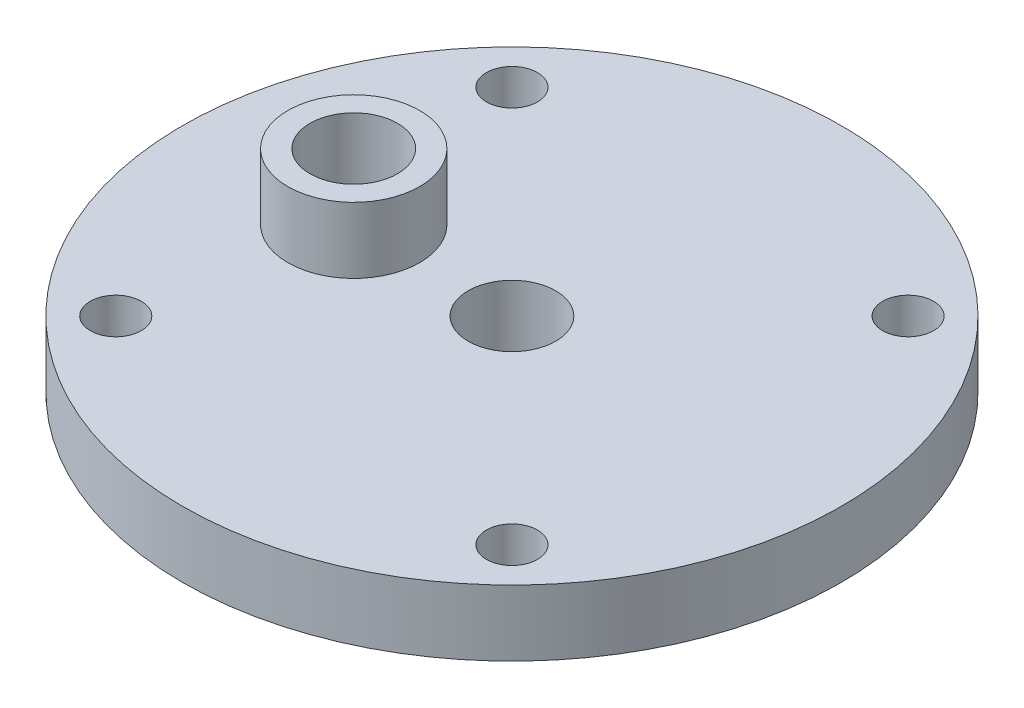
ISO-10303-21;
HEADER;
FILE_DESCRIPTION(('STEP AP214'),'2;1');
FILE_NAME('part.step','',(''),(''),'','','');
FILE_SCHEMA(('AUTOMOTIVE_DESIGN { 1 0 10303 214 1 1 1 1 }'));
ENDSEC;
DATA;
#1=APPLICATION_CONTEXT('core data for automotive mechanical design processes');
#2=APPLICATION_PROTOCOL_DEFINITION('international standard','automotive_design',2000,#1);
#3=PRODUCT_CONTEXT('',#1,'mechanical');
#4=PRODUCT('Part','Part','',(#3));
#5=PRODUCT_RELATED_PRODUCT_CATEGORY('part','',(#4));
#6=PRODUCT_DEFINITION_FORMATION('','',#4);
#7=PRODUCT_DEFINITION_CONTEXT('part definition',#1,'design');
#8=PRODUCT_DEFINITION('design','',#6,#7);
#9=PRODUCT_DEFINITION_SHAPE('','',#8);
#10=(LENGTH_UNIT() NAMED_UNIT(*) SI_UNIT(.MILLI.,.METRE.));
#11=(NAMED_UNIT(*) PLANE_ANGLE_UNIT() SI_UNIT($,.RADIAN.));
#12=(NAMED_UNIT(*) SI_UNIT($,.STERADIAN.) SOLID_ANGLE_UNIT());
#13=UNCERTAINTY_MEASURE_WITH_UNIT(LENGTH_MEASURE(1.E-05),#10,'distance_accuracy_value','');
#14=(GEOMETRIC_REPRESENTATION_CONTEXT(3) GLOBAL_UNCERTAINTY_ASSIGNED_CONTEXT((#13)) GLOBAL_UNIT_ASSIGNED_CONTEXT((#10,
#11,#12)) REPRESENTATION_CONTEXT('',''));
#15=CARTESIAN_POINT('',(0.,0.,0.));
#16=DIRECTION('',(0.,0.,1.));
#17=DIRECTION('',(1.,0.,0.));
#18=AXIS2_PLACEMENT_3D('',#15,#16,#17);
#19=CARTESIAN_POINT('',(0.,0.,0.));
#20=DIRECTION('',(0.,-1.,0.));
#21=DIRECTION('',(0.,0.,-1.));
#22=AXIS2_PLACEMENT_3D('',#19,#20,#21);
#23=PLANE('',#22);
#24=CARTESIAN_POINT('',(0.,0.,-6.34999999999999));
#25=DIRECTION('',(0.,-1.,0.));
#26=DIRECTION('',(0.,0.,-1.));
#27=AXIS2_PLACEMENT_3D('',#24,#25,#26);
#28=ELLIPSE('',#27,0.359210244842765,0.253999999999999);
#29=CARTESIAN_POINT('',(0.,0.,-6.70921024484276));
#30=VERTEX_POINT('',#29);
#31=EDGE_CURVE('E183',#30,#30,#28,.T.);
#32=ORIENTED_EDGE('',*,*,#31,.F.);
#33=EDGE_LOOP('',(#32));
#34=FACE_BOUND('',#33,.T.);
#35=CARTESIAN_POINT('',(-6.34999999999999,0.,0.));
#36=DIRECTION('',(0.,-1.,0.));
#37=DIRECTION('',(-1.,0.,0.));
#38=AXIS2_PLACEMENT_3D('',#35,#36,#37);
#39=ELLIPSE('',#38,0.359210244842765,0.253999999999999);
#40=CARTESIAN_POINT('',(-6.70921024484276,0.,0.));
#41=VERTEX_POINT('',#40);
#42=EDGE_CURVE('E187',#41,#41,#39,.T.);
#43=ORIENTED_EDGE('',*,*,#42,.F.);
#44=EDGE_LOOP('',(#43));
#45=FACE_BOUND('',#44,.T.);
#46=CARTESIAN_POINT('',(0.,0.,6.34999999999999));
#47=DIRECTION('',(0.,-1.,0.));
#48=DIRECTION('',(0.,0.,1.));
#49=AXIS2_PLACEMENT_3D('',#46,#47,#48);
#50=ELLIPSE('',#49,0.359210244842765,0.253999999999999);
#51=CARTESIAN_POINT('',(0.,0.,6.70921024484276));
#52=VERTEX_POINT('',#51);
#53=EDGE_CURVE('E191',#52,#52,#50,.T.);
#54=ORIENTED_EDGE('',*,*,#53,.F.);
#55=EDGE_LOOP('',(#54));
#56=FACE_BOUND('',#55,.T.);
#57=CARTESIAN_POINT('',(6.34999999999999,0.,0.));
#58=DIRECTION('',(0.,-1.,0.));
#59=DIRECTION('',(1.,0.,0.));
#60=AXIS2_PLACEMENT_3D('',#57,#58,#59);
#61=ELLIPSE('',#60,0.359210244842765,0.253999999999999);
#62=CARTESIAN_POINT('',(6.70921024484276,0.,0.));
#63=VERTEX_POINT('',#62);
#64=EDGE_CURVE('E195',#63,#63,#61,.T.);
#65=ORIENTED_EDGE('',*,*,#64,.F.);
#66=EDGE_LOOP('',(#65));
#67=FACE_BOUND('',#66,.T.);
#68=CARTESIAN_POINT('',(0.,0.,0.));
#69=DIRECTION('',(0.,-1.,0.));
#70=DIRECTION('',(0.,0.,-1.));
#71=AXIS2_PLACEMENT_3D('',#68,#69,#70);
#72=CIRCLE('',#71,4.21639999999999);
#73=CARTESIAN_POINT('',(0.,0.,-4.21639999999999));
#74=VERTEX_POINT('',#73);
#75=EDGE_CURVE('E199',#74,#74,#72,.T.);
#76=ORIENTED_EDGE('',*,*,#75,.F.);
#77=EDGE_LOOP('',(#76));
#78=FACE_BOUND('',#77,.T.);
#79=CARTESIAN_POINT('',(0.,0.,0.));
#80=DIRECTION('',(0.,1.,0.));
#81=DIRECTION('',(0.,0.,1.));
#82=AXIS2_PLACEMENT_3D('',#79,#80,#81);
#83=CIRCLE('',#82,15.875);
#84=CARTESIAN_POINT('',(0.,0.,15.875));
#85=VERTEX_POINT('',#84);
#86=EDGE_CURVE('E119',#85,#85,#83,.T.);
#87=ORIENTED_EDGE('',*,*,#86,.F.);
#88=EDGE_LOOP('',(#87));
#89=FACE_BOUND('',#88,.T.);
#90=ADVANCED_FACE('F37',(#34,#45,#56,#67,#78,#89),#23,.T.);
#91=CARTESIAN_POINT('',(0.,14.2875,0.));
#92=DIRECTION('',(0.,1.,0.));
#93=DIRECTION('',(0.,0.,1.));
#94=AXIS2_PLACEMENT_3D('',#91,#92,#93);
#95=CYLINDRICAL_SURFACE('',#94,15.875);
#96=ORIENTED_EDGE('',*,*,#86,.T.);
#97=EDGE_LOOP('',(#96));
#98=FACE_BOUND('',#97,.T.);
#99=CARTESIAN_POINT('',(0.,3.175,0.));
#100=DIRECTION('',(0.,1.,0.));
#101=DIRECTION('',(0.,0.,1.));
#102=AXIS2_PLACEMENT_3D('',#99,#100,#101);
#103=CIRCLE('',#102,15.875);
#104=CARTESIAN_POINT('',(0.,3.175,15.875));
#105=VERTEX_POINT('',#104);
#106=EDGE_CURVE('E115',#105,#105,#103,.T.);
#107=ORIENTED_EDGE('',*,*,#106,.F.);
#108=EDGE_LOOP('',(#107));
#109=FACE_BOUND('',#108,.T.);
#110=ADVANCED_FACE('F174',(#98,#109),#95,.T.);
#111=CARTESIAN_POINT('',(-15.875,3.175,0.));
#112=DIRECTION('',(0.,1.,0.));
#113=DIRECTION('',(0.,0.,1.));
#114=AXIS2_PLACEMENT_3D('',#111,#112,#113);
#115=PLANE('',#114);
#116=CARTESIAN_POINT('',(0.,3.175,-9.52499999999999));
#117=DIRECTION('',(0.,1.,0.));
#118=DIRECTION('',(0.,0.,-1.));
#119=AXIS2_PLACEMENT_3D('',#116,#117,#118);
#120=ELLIPSE('',#119,0.359210244842765,0.253999999999999);
#121=CARTESIAN_POINT('',(0.253988708852886,3.175,-9.52161303224276));
#122=VERTEX_POINT('',#121);
#123=CARTESIAN_POINT('',(-0.253988708852687,3.175,-9.52161303224277));
#124=VERTEX_POINT('',#123);
#125=EDGE_CURVE('E57',#122,#124,#120,.T.);
#126=ORIENTED_EDGE('',*,*,#125,.F.);
#127=CARTESIAN_POINT('',(0.,3.175,0.));
#128=DIRECTION('',(0.,1.,0.));
#129=DIRECTION('',(0.,0.,1.));
#130=AXIS2_PLACEMENT_3D('',#127,#128,#129);
#131=CIRCLE('',#130,9.525);
#132=CARTESIAN_POINT('',(9.52161303224277,3.175,-0.253988708852786));
#133=VERTEX_POINT('',#132);
#134=EDGE_CURVE('E112',#133,#122,#131,.T.);
#135=ORIENTED_EDGE('',*,*,#134,.F.);
#136=CARTESIAN_POINT('',(9.52499999999999,3.175,0.));
#137=DIRECTION('',(0.,1.,0.));
#138=DIRECTION('',(1.,0.,0.));
#139=AXIS2_PLACEMENT_3D('',#136,#137,#138);
#140=ELLIPSE('',#139,0.359210244842765,0.253999999999999);
#141=CARTESIAN_POINT('',(9.52161303224277,3.175,0.253988708852786));
#142=VERTEX_POINT('',#141);
#143=EDGE_CURVE('E219',#142,#133,#140,.T.);
#144=ORIENTED_EDGE('',*,*,#143,.F.);
#145=CARTESIAN_POINT('',(0.253988708852753,3.175,9.52161303224277));
#146=VERTEX_POINT('',#145);
#147=EDGE_CURVE('E106',#146,#142,#131,.T.);
#148=ORIENTED_EDGE('',*,*,#147,.F.);
#149=CARTESIAN_POINT('',(0.,3.175,9.52499999999999));
#150=DIRECTION('',(0.,1.,0.));
#151=DIRECTION('',(0.,0.,1.));
#152=AXIS2_PLACEMENT_3D('',#149,#150,#151);
#153=ELLIPSE('',#152,0.359210244842765,0.253999999999999);
#154=CARTESIAN_POINT('',(-0.25398870885282,3.175,9.52161303224276));
#155=VERTEX_POINT('',#154);
#156=EDGE_CURVE('E224',#155,#146,#153,.T.);
#157=ORIENTED_EDGE('',*,*,#156,.F.);
#158=CARTESIAN_POINT('',(-9.52161303224277,3.175,0.253988708852786));
#159=VERTEX_POINT('',#158);
#160=EDGE_CURVE('E334',#159,#155,#131,.T.);
#161=ORIENTED_EDGE('',*,*,#160,.F.);
#162=CARTESIAN_POINT('',(-9.52499999999999,3.175,0.));
#163=DIRECTION('',(0.,1.,0.));
#164=DIRECTION('',(-1.,0.,0.));
#165=AXIS2_PLACEMENT_3D('',#162,#163,#164);
#166=ELLIPSE('',#165,0.359210244842765,0.253999999999999);
#167=CARTESIAN_POINT('',(-9.52161303224277,3.175,-0.253988708852786));
#168=VERTEX_POINT('',#167);
#169=EDGE_CURVE('E244',#168,#159,#166,.T.);
#170=ORIENTED_EDGE('',*,*,#169,.F.);
#171=EDGE_CURVE('E116',#124,#168,#131,.T.);
#172=ORIENTED_EDGE('',*,*,#171,.F.);
#173=EDGE_LOOP('',(#126,#135,#144,#148,#157,#161,#170,#172));
#174=FACE_BOUND('',#173,.T.);
#175=ORIENTED_EDGE('',*,*,#106,.T.);
#176=EDGE_LOOP('',(#175));
#177=FACE_BOUND('',#176,.T.);
#178=ADVANCED_FACE('F171',(#174,#177),#115,.T.);
#179=CARTESIAN_POINT('',(0.,14.2875,0.));
#180=DIRECTION('',(0.,1.,0.));
#181=DIRECTION('',(0.,0.,1.));
#182=AXIS2_PLACEMENT_3D('',#179,#180,#181);
#183=CYLINDRICAL_SURFACE('',#182,9.525);
#184=CARTESIAN_POINT('',(-0.253988708852687,3.175,-9.52161303224277));
#185=CARTESIAN_POINT('',(-0.253762310380255,3.20265585750623,-9.52161504756113));
#186=CARTESIAN_POINT('',(-0.251352995068558,3.23039204658245,-9.52168301476661));
#187=CARTESIAN_POINT('',(-0.241853833190986,3.28533392360139,-9.52193133421066));
#188=CARTESIAN_POINT('',(-0.234715918134479,3.31253117755965,-9.5221128395515));
#189=CARTESIAN_POINT('',(-0.218358164602399,3.35713046459756,-9.5224989014196));
#190=CARTESIAN_POINT('',(-0.210424196374653,3.37500378633972,-9.52267981537316));
#191=CARTESIAN_POINT('',(-0.191940447112796,3.40930477629347,-9.52307043721314));
#192=CARTESIAN_POINT('',(-0.181399952222309,3.42573730195421,-9.5232800417264));
#193=CARTESIAN_POINT('',(-0.16072081194238,3.45229524343193,-9.52364790521498));
#194=CARTESIAN_POINT('',(-0.151236194408672,3.46292848395282,-9.52380481588724));
#195=CARTESIAN_POINT('',(-0.130716631136981,3.48259108965602,-9.52410852403132));
#196=CARTESIAN_POINT('',(-0.119683543210044,3.49162234787972,-9.52425533331249));
#197=CARTESIAN_POINT('',(-0.0986009468671517,3.50585400616589,-9.52449418016102));
#198=CARTESIAN_POINT('',(-0.0888270926466748,3.51146054985754,-9.52459125353317));
#199=CARTESIAN_POINT('',(-0.0684867399872461,3.52099509660636,-9.52475919099708));
#200=CARTESIAN_POINT('',(-0.0579208147797949,3.52492430004839,-9.52483007382715));
#201=CARTESIAN_POINT('',(-0.0361677863760888,3.53083391022371,-9.52493757139543));
#202=CARTESIAN_POINT('',(-0.0249768337323059,3.53280040261146,-9.52497394137182));
#203=CARTESIAN_POINT('',(-0.00242574338453218,3.53455440588581,-9.52500634993189));
#204=CARTESIAN_POINT('',(0.00893431429477872,3.53434291664427,-9.52500240702251));
#205=CARTESIAN_POINT('',(0.0301416603854675,3.53191109454994,-9.52495755460249));
#206=CARTESIAN_POINT('',(0.0400161323698642,3.52991789763793,-9.5249208254699));
#207=CARTESIAN_POINT('',(0.0593147600747716,3.52437600476957,-9.52482020620429));
#208=CARTESIAN_POINT('',(0.0687388255064597,3.52082699837295,-9.52475631065067));
#209=CARTESIAN_POINT('',(0.0873967849019367,3.51217909651797,-9.52460383298033));
#210=CARTESIAN_POINT('',(0.0965994625743298,3.50701357075855,-9.52451420679547));
#211=CARTESIAN_POINT('',(0.114201058188755,3.49546698046043,-9.52431943572887));
#212=CARTESIAN_POINT('',(0.122599552060628,3.48908527984248,-9.52421428273287));
#213=CARTESIAN_POINT('',(0.143154502534424,3.47138090609201,-9.52393251139403));
#214=CARTESIAN_POINT('',(0.154686131902399,3.45933074890186,-9.52374964140267));
#215=CARTESIAN_POINT('',(0.175688377065705,3.43354540149817,-9.5233853842257));
#216=CARTESIAN_POINT('',(0.185153417622517,3.41980580569167,-9.52320400229142));
#217=CARTESIAN_POINT('',(0.205495145645364,3.38550286469517,-9.52279047636847));
#218=CARTESIAN_POINT('',(0.215446560774838,3.36439191301757,-9.52256667442027));
#219=CARTESIAN_POINT('',(0.231869175287278,3.32086299206787,-9.52218086016359));
#220=CARTESIAN_POINT('',(0.238335691826847,3.29844330876932,-9.5220189310815));
#221=CARTESIAN_POINT('',(0.2466866766919,3.2590999999945,-9.52180566013396));
#222=CARTESIAN_POINT('',(0.249337943823236,3.24233328879731,-9.5217362419771));
#223=CARTESIAN_POINT('',(0.252924775501788,3.20871213745041,-9.52164140518111));
#224=CARTESIAN_POINT('',(0.253869940229587,3.19185872674099,-9.52161574038898));
#225=CARTESIAN_POINT('',(0.253988708852886,3.175,-9.52161303224276));
#226=B_SPLINE_CURVE_WITH_KNOTS('',3,(#184,#185,#186,#187,#188,#189,#190,#191,#192,#193,#194,
#195,#196,#197,#198,#199,#200,#201,#202,#203,#204,#205,#206,#207,#208,#209,#210,#211,#212,#213,
#214,#215,#216,#217,#218,#219,#220,#221,#222,#223,#224,#225),.UNSPECIFIED.,.F.,.F.,(4,2,2,2,2,2,
2,2,2,2,2,2,2,2,2,2,2,2,2,2,4),(0.,0.0830489779831655,0.166955416075598,0.225441836053683,
0.2837228177842,0.326332802552292,0.368892095272986,0.402564876039762,0.436213518391679,
0.470099048513841,0.503969023097582,0.534053919690414,0.564144822042937,0.595690364106974,
0.627252450509459,0.677010263021198,0.726900697383764,0.796547864387975,0.866288388098834,
0.917131095401339,0.967686809951884),.UNSPECIFIED.);
#227=EDGE_CURVE('E44',#124,#122,#226,.T.);
#228=ORIENTED_EDGE('',*,*,#227,.F.);
#229=ORIENTED_EDGE('',*,*,#171,.T.);
#230=CARTESIAN_POINT('',(-9.52161303224277,3.175,0.253988708852786));
#231=CARTESIAN_POINT('',(-9.52161504756113,3.20265585750623,0.253762310380354));
#232=CARTESIAN_POINT('',(-9.52168301476661,3.23039204658245,0.251352995068657));
#233=CARTESIAN_POINT('',(-9.52193133421066,3.2853339236014,0.241853833191085));
#234=CARTESIAN_POINT('',(-9.5221128395515,3.31253117755965,0.234715918134578));
#235=CARTESIAN_POINT('',(-9.5224989014196,3.35713046459757,0.218358164602498));
#236=CARTESIAN_POINT('',(-9.52267981537315,3.37500378633972,0.21042419637475));
#237=CARTESIAN_POINT('',(-9.52307043721313,3.40930477629347,0.191940447112894));
#238=CARTESIAN_POINT('',(-9.5232800417264,3.42573730195422,0.181399952222408));
#239=CARTESIAN_POINT('',(-9.52364790521498,3.45229524343193,0.160720811942479));
#240=CARTESIAN_POINT('',(-9.52380481588724,3.46292848395282,0.151236194408771));
#241=CARTESIAN_POINT('',(-9.52410852403132,3.48259108965602,0.130716631137079));
#242=CARTESIAN_POINT('',(-9.52425533331249,3.49162234787972,0.119683543210142));
#243=CARTESIAN_POINT('',(-9.52449418016102,3.50585400616589,0.0986009468672503));
#244=CARTESIAN_POINT('',(-9.52459125353317,3.51146054985754,0.0888270926467736));
#245=CARTESIAN_POINT('',(-9.52475919099708,3.52099509660636,0.0684867399873451));
#246=CARTESIAN_POINT('',(-9.52483007382715,3.52492430004839,0.0579208147798937));
#247=CARTESIAN_POINT('',(-9.52493757139542,3.53083391022371,0.036167786376188));
#248=CARTESIAN_POINT('',(-9.52497394137182,3.53280040261146,0.0249768337324055));
#249=CARTESIAN_POINT('',(-9.5250063499319,3.53455440588581,0.00242574338463219));
#250=CARTESIAN_POINT('',(-9.52500240702251,3.53434291664427,-0.00893431429467862));
#251=CARTESIAN_POINT('',(-9.52495755460249,3.53191109454994,-0.0301416603853672));
#252=CARTESIAN_POINT('',(-9.5249208254699,3.52991789763793,-0.0400161323697638));
#253=CARTESIAN_POINT('',(-9.52482020620429,3.52437600476957,-0.0593147600746713));
#254=CARTESIAN_POINT('',(-9.52475631065067,3.52082699837295,-0.0687388255063596));
#255=CARTESIAN_POINT('',(-9.52460383298033,3.51217909651798,-0.0873967849018369));
#256=CARTESIAN_POINT('',(-9.52451420679547,3.50701357075856,-0.0965994625742299));
#257=CARTESIAN_POINT('',(-9.52431943572887,3.49546698046043,-0.114201058188655));
#258=CARTESIAN_POINT('',(-9.52421428273287,3.48908527984248,-0.122599552060528));
#259=CARTESIAN_POINT('',(-9.52393251139404,3.47138090609201,-0.143154502534324));
#260=CARTESIAN_POINT('',(-9.52374964140267,3.45933074890186,-0.1546861319023));
#261=CARTESIAN_POINT('',(-9.5233853842257,3.43354540149817,-0.175688377065605));
#262=CARTESIAN_POINT('',(-9.52320400229142,3.41980580569167,-0.185153417622418));
#263=CARTESIAN_POINT('',(-9.52279047636847,3.38550286469517,-0.205495145645264));
#264=CARTESIAN_POINT('',(-9.52256667442027,3.36439191301757,-0.215446560774739));
#265=CARTESIAN_POINT('',(-9.52218086016359,3.32086299206787,-0.231869175287179));
#266=CARTESIAN_POINT('',(-9.52201893108151,3.29844330876932,-0.238335691826748));
#267=CARTESIAN_POINT('',(-9.52180566013396,3.2590999999945,-0.246686676691801));
#268=CARTESIAN_POINT('',(-9.5217362419771,3.24233328879731,-0.249337943823137));
#269=CARTESIAN_POINT('',(-9.52164140518112,3.20871213745041,-0.252924775501688));
#270=CARTESIAN_POINT('',(-9.52161574038898,3.19185872674099,-0.253869940229487));
#271=CARTESIAN_POINT('',(-9.52161303224276,3.175,-0.253988708852786));
#272=B_SPLINE_CURVE_WITH_KNOTS('',3,(#230,#231,#232,#233,#234,#235,#236,#237,#238,#239,#240,
#241,#242,#243,#244,#245,#246,#247,#248,#249,#250,#251,#252,#253,#254,#255,#256,#257,#258,#259,
#260,#261,#262,#263,#264,#265,#266,#267,#268,#269,#270,#271),.UNSPECIFIED.,.F.,.F.,(4,2,2,2,2,2,
2,2,2,2,2,2,2,2,2,2,2,2,2,2,4),(0.,0.0830489779831668,0.166955416075601,0.225441836053685,
0.283722817784202,0.326332802552293,0.368892095272987,0.402564876039763,0.436213518391679,
0.47009904851384,0.503969023097581,0.534053919690413,0.564144822042936,0.595690364106973,
0.627252450509458,0.677010263021198,0.726900697383764,0.796547864387975,0.866288388098834,
0.917131095401339,0.967686809951884),.UNSPECIFIED.);
#273=EDGE_CURVE('E323',#159,#168,#272,.T.);
#274=ORIENTED_EDGE('',*,*,#273,.F.);
#275=ORIENTED_EDGE('',*,*,#160,.T.);
#276=CARTESIAN_POINT('',(0.253988708852753,3.175,9.52161303224277));
#277=CARTESIAN_POINT('',(0.253762310380322,3.20265585750623,9.52161504756113));
#278=CARTESIAN_POINT('',(0.251352995068624,3.23039204658245,9.52168301476661));
#279=CARTESIAN_POINT('',(0.241853833191052,3.2853339236014,9.52193133421066));
#280=CARTESIAN_POINT('',(0.234715918134545,3.31253117755965,9.5221128395515));
#281=CARTESIAN_POINT('',(0.218358164602465,3.35713046459757,9.5224989014196));
#282=CARTESIAN_POINT('',(0.210424196374718,3.37500378633972,9.52267981537315));
#283=CARTESIAN_POINT('',(0.191940447112861,3.40930477629347,9.52307043721313));
#284=CARTESIAN_POINT('',(0.181399952222375,3.42573730195422,9.5232800417264));
#285=CARTESIAN_POINT('',(0.160720811942446,3.45229524343193,9.52364790521498));
#286=CARTESIAN_POINT('',(0.151236194408738,3.46292848395282,9.52380481588724));
#287=CARTESIAN_POINT('',(0.130716631137047,3.48259108965602,9.52410852403132));
#288=CARTESIAN_POINT('',(0.11968354321011,3.49162234787972,9.52425533331249));
#289=CARTESIAN_POINT('',(0.0986009468672178,3.50585400616589,9.52449418016102));
#290=CARTESIAN_POINT('',(0.0888270926467405,3.51146054985754,9.52459125353317));
#291=CARTESIAN_POINT('',(0.0684867399873118,3.52099509660636,9.52475919099708));
#292=CARTESIAN_POINT('',(0.0579208147798607,3.52492430004839,9.52483007382715));
#293=CARTESIAN_POINT('',(0.0361677863761551,3.53083391022371,9.52493757139542));
#294=CARTESIAN_POINT('',(0.0249768337323725,3.53280040261145,9.52497394137182));
#295=CARTESIAN_POINT('',(0.0024257433845991,3.53455440588581,9.5250063499319));
#296=CARTESIAN_POINT('',(-0.00893431429471164,3.53434291664427,9.52500240702251));
#297=CARTESIAN_POINT('',(-0.0301416603854002,3.53191109454994,9.52495755460249));
#298=CARTESIAN_POINT('',(-0.040016132369797,3.52991789763793,9.5249208254699));
#299=CARTESIAN_POINT('',(-0.0593147600747045,3.52437600476957,9.52482020620429));
#300=CARTESIAN_POINT('',(-0.0687388255063927,3.52082699837295,9.52475631065067));
#301=CARTESIAN_POINT('',(-0.0873967849018698,3.51217909651797,9.52460383298033));
#302=CARTESIAN_POINT('',(-0.0965994625742628,3.50701357075855,9.52451420679547));
#303=CARTESIAN_POINT('',(-0.114201058188688,3.49546698046043,9.52431943572887));
#304=CARTESIAN_POINT('',(-0.122599552060562,3.48908527984248,9.52421428273287));
#305=CARTESIAN_POINT('',(-0.143154502534358,3.47138090609201,9.52393251139404));
#306=CARTESIAN_POINT('',(-0.154686131902333,3.45933074890186,9.52374964140267));
#307=CARTESIAN_POINT('',(-0.175688377065639,3.43354540149817,9.5233853842257));
#308=CARTESIAN_POINT('',(-0.185153417622451,3.41980580569167,9.52320400229142));
#309=CARTESIAN_POINT('',(-0.205495145645298,3.38550286469517,9.52279047636847));
#310=CARTESIAN_POINT('',(-0.215446560774773,3.36439191301757,9.52256667442027));
#311=CARTESIAN_POINT('',(-0.231869175287212,3.32086299206787,9.52218086016359));
#312=CARTESIAN_POINT('',(-0.238335691826781,3.29844330876932,9.5220189310815));
#313=CARTESIAN_POINT('',(-0.246686676691834,3.2590999999945,9.52180566013396));
#314=CARTESIAN_POINT('',(-0.24933794382317,3.24233328879731,9.5217362419771));
#315=CARTESIAN_POINT('',(-0.252924775501721,3.20871213745041,9.52164140518112));
#316=CARTESIAN_POINT('',(-0.25386994022952,3.19185872674099,9.52161574038898));
#317=CARTESIAN_POINT('',(-0.253988708852819,3.175,9.52161303224276));
#318=B_SPLINE_CURVE_WITH_KNOTS('',3,(#276,#277,#278,#279,#280,#281,#282,#283,#284,#285,#286,
#287,#288,#289,#290,#291,#292,#293,#294,#295,#296,#297,#298,#299,#300,#301,#302,#303,#304,#305,
#306,#307,#308,#309,#310,#311,#312,#313,#314,#315,#316,#317),.UNSPECIFIED.,.F.,.F.,(4,2,2,2,2,2,
2,2,2,2,2,2,2,2,2,2,2,2,2,2,4),(0.,0.0830489779831668,0.1669554160756,0.225441836053685,
0.283722817784202,0.326332802552293,0.368892095272987,0.402564876039763,0.436213518391679,
0.47009904851384,0.503969023097581,0.534053919690413,0.564144822042937,0.595690364106974,
0.627252450509458,0.677010263021199,0.726900697383764,0.796547864387976,0.866288388098835,
0.917131095401339,0.967686809951884),.UNSPECIFIED.);
#319=EDGE_CURVE('E131',#146,#155,#318,.T.);
#320=ORIENTED_EDGE('',*,*,#319,.F.);
#321=ORIENTED_EDGE('',*,*,#147,.T.);
#322=CARTESIAN_POINT('',(9.52161303224277,3.175,-0.253988708852786));
#323=CARTESIAN_POINT('',(9.52161504756113,3.20265585750623,-0.253762310380354));
#324=CARTESIAN_POINT('',(9.52168301476661,3.23039204658245,-0.251352995068657));
#325=CARTESIAN_POINT('',(9.52193133421066,3.2853339236014,-0.241853833191085));
#326=CARTESIAN_POINT('',(9.5221128395515,3.31253117755965,-0.234715918134578));
#327=CARTESIAN_POINT('',(9.5224989014196,3.35713046459757,-0.218358164602498));
#328=CARTESIAN_POINT('',(9.52267981537315,3.37500378633972,-0.21042419637475));
#329=CARTESIAN_POINT('',(9.52307043721313,3.40930477629347,-0.191940447112894));
#330=CARTESIAN_POINT('',(9.5232800417264,3.42573730195422,-0.181399952222408));
#331=CARTESIAN_POINT('',(9.52364790521498,3.45229524343193,-0.160720811942479));
#332=CARTESIAN_POINT('',(9.52380481588724,3.46292848395282,-0.151236194408771));
#333=CARTESIAN_POINT('',(9.52410852403132,3.48259108965602,-0.130716631137079));
#334=CARTESIAN_POINT('',(9.52425533331249,3.49162234787972,-0.119683543210142));
#335=CARTESIAN_POINT('',(9.52449418016102,3.50585400616589,-0.0986009468672503));
#336=CARTESIAN_POINT('',(9.52459125353317,3.51146054985754,-0.0888270926467736));
#337=CARTESIAN_POINT('',(9.52475919099708,3.52099509660636,-0.0684867399873451));
#338=CARTESIAN_POINT('',(9.52483007382715,3.52492430004839,-0.0579208147798937));
#339=CARTESIAN_POINT('',(9.52493757139542,3.53083391022371,-0.036167786376188));
#340=CARTESIAN_POINT('',(9.52497394137182,3.53280040261146,-0.0249768337324055));
#341=CARTESIAN_POINT('',(9.5250063499319,3.53455440588581,-0.00242574338463219));
#342=CARTESIAN_POINT('',(9.52500240702251,3.53434291664427,0.00893431429467862));
#343=CARTESIAN_POINT('',(9.52495755460249,3.53191109454994,0.0301416603853672));
#344=CARTESIAN_POINT('',(9.5249208254699,3.52991789763793,0.0400161323697638));
#345=CARTESIAN_POINT('',(9.52482020620429,3.52437600476957,0.0593147600746713));
#346=CARTESIAN_POINT('',(9.52475631065067,3.52082699837295,0.0687388255063596));
#347=CARTESIAN_POINT('',(9.52460383298033,3.51217909651798,0.0873967849018369));
#348=CARTESIAN_POINT('',(9.52451420679547,3.50701357075856,0.0965994625742299));
#349=CARTESIAN_POINT('',(9.52431943572887,3.49546698046043,0.114201058188655));
#350=CARTESIAN_POINT('',(9.52421428273287,3.48908527984248,0.122599552060528));
#351=CARTESIAN_POINT('',(9.52393251139404,3.47138090609201,0.143154502534324));
#352=CARTESIAN_POINT('',(9.52374964140267,3.45933074890186,0.1546861319023));
#353=CARTESIAN_POINT('',(9.5233853842257,3.43354540149817,0.175688377065605));
#354=CARTESIAN_POINT('',(9.52320400229142,3.41980580569167,0.185153417622418));
#355=CARTESIAN_POINT('',(9.52279047636847,3.38550286469517,0.205495145645264));
#356=CARTESIAN_POINT('',(9.52256667442027,3.36439191301757,0.215446560774739));
#357=CARTESIAN_POINT('',(9.52218086016359,3.32086299206787,0.231869175287179));
#358=CARTESIAN_POINT('',(9.52201893108151,3.29844330876932,0.238335691826748));
#359=CARTESIAN_POINT('',(9.52180566013396,3.2590999999945,0.246686676691801));
#360=CARTESIAN_POINT('',(9.5217362419771,3.24233328879731,0.249337943823137));
#361=CARTESIAN_POINT('',(9.52164140518112,3.20871213745041,0.252924775501688));
#362=CARTESIAN_POINT('',(9.52161574038898,3.19185872674099,0.253869940229487));
#363=CARTESIAN_POINT('',(9.52161303224276,3.175,0.253988708852786));
#364=B_SPLINE_CURVE_WITH_KNOTS('',3,(#322,#323,#324,#325,#326,#327,#328,#329,#330,#331,#332,
#333,#334,#335,#336,#337,#338,#339,#340,#341,#342,#343,#344,#345,#346,#347,#348,#349,#350,#351,
#352,#353,#354,#355,#356,#357,#358,#359,#360,#361,#362,#363),.UNSPECIFIED.,.F.,.F.,(4,2,2,2,2,2,
2,2,2,2,2,2,2,2,2,2,2,2,2,2,4),(0.,0.0830489779831668,0.166955416075601,0.225441836053685,
0.283722817784202,0.326332802552293,0.368892095272987,0.402564876039763,0.436213518391679,
0.47009904851384,0.503969023097581,0.534053919690413,0.564144822042936,0.595690364106973,
0.627252450509458,0.677010263021198,0.726900697383764,0.796547864387975,0.866288388098834,
0.917131095401339,0.967686809951884),.UNSPECIFIED.);
#365=EDGE_CURVE('E122',#133,#142,#364,.T.);
#366=ORIENTED_EDGE('',*,*,#365,.F.);
#367=ORIENTED_EDGE('',*,*,#134,.T.);
#368=EDGE_LOOP('',(#228,#229,#274,#275,#320,#321,#366,#367));
#369=FACE_BOUND('',#368,.T.);
#370=CARTESIAN_POINT('',(0.,6.35,0.));
#371=DIRECTION('',(0.,1.,0.));
#372=DIRECTION('',(0.,0.,1.));
#373=AXIS2_PLACEMENT_3D('',#370,#371,#372);
#374=CIRCLE('',#373,9.525);
#375=CARTESIAN_POINT('',(0.,6.35,9.525));
#376=VERTEX_POINT('',#375);
#377=EDGE_CURVE('E103',#376,#376,#374,.T.);
#378=ORIENTED_EDGE('',*,*,#377,.F.);
#379=EDGE_LOOP('',(#378));
#380=FACE_BOUND('',#379,.T.);
#381=ADVANCED_FACE('F138',(#369,#380),#183,.T.);
#382=CARTESIAN_POINT('',(-15.875,6.35,0.));
#383=DIRECTION('',(0.,-1.,0.));
#384=DIRECTION('',(0.,0.,-1.));
#385=AXIS2_PLACEMENT_3D('',#382,#383,#384);
#386=PLANE('',#385);
#387=CARTESIAN_POINT('',(-15.24,6.35,0.));
#388=DIRECTION('',(0.,-1.,0.));
#389=DIRECTION('',(0.,0.,-1.));
#390=AXIS2_PLACEMENT_3D('',#387,#388,#389);
#391=CIRCLE('',#390,1.58749999999999);
#392=CARTESIAN_POINT('',(-15.805546875,6.35,-1.48334519993751));
#393=VERTEX_POINT('',#392);
#394=CARTESIAN_POINT('',(-15.805546875,6.35,1.48334519993753));
#395=VERTEX_POINT('',#394);
#396=EDGE_CURVE('E11',#393,#395,#391,.T.);
#397=ORIENTED_EDGE('',*,*,#396,.F.);
#398=CARTESIAN_POINT('',(0.,6.35,0.));
#399=DIRECTION('',(0.,1.,0.));
#400=DIRECTION('',(0.,0.,1.));
#401=AXIS2_PLACEMENT_3D('',#398,#399,#400);
#402=CIRCLE('',#401,15.875);
#403=EDGE_CURVE('E96',#395,#393,#402,.T.);
#404=ORIENTED_EDGE('',*,*,#403,.F.);
#405=EDGE_LOOP('',(#397,#404));
#406=FACE_BOUND('',#405,.T.);
#407=ORIENTED_EDGE('',*,*,#377,.T.);
#408=EDGE_LOOP('',(#407));
#409=FACE_BOUND('',#408,.T.);
#410=ADVANCED_FACE('F101',(#406,#409),#386,.T.);
#411=CARTESIAN_POINT('',(0.,14.2875,0.));
#412=DIRECTION('',(0.,1.,0.));
#413=DIRECTION('',(0.,0.,1.));
#414=AXIS2_PLACEMENT_3D('',#411,#412,#413);
#415=CYLINDRICAL_SURFACE('',#414,15.875);
#416=DIRECTION('',(0.,1.,0.));
#417=VECTOR('',#416,1.);
#418=CARTESIAN_POINT('',(-15.805546875,13.49375,1.48334519993753));
#419=LINE('',#418,#417);
#420=CARTESIAN_POINT('',(-15.805546875,7.9375,1.48334519993751));
#421=VERTEX_POINT('',#420);
#422=EDGE_CURVE('E88',#395,#421,#419,.T.);
#423=ORIENTED_EDGE('',*,*,#422,.F.);
#424=ORIENTED_EDGE('',*,*,#403,.T.);
#425=DIRECTION('',(0.,1.,0.));
#426=VECTOR('',#425,1.);
#427=CARTESIAN_POINT('',(-15.805546875,13.49375,-1.48334519993753));
#428=LINE('',#427,#426);
#429=CARTESIAN_POINT('',(-15.805546875,7.9375,-1.48334519993751));
#430=VERTEX_POINT('',#429);
#431=EDGE_CURVE('E50',#430,#393,#428,.F.);
#432=ORIENTED_EDGE('',*,*,#431,.F.);
#433=CARTESIAN_POINT('',(0.,7.9375,0.));
#434=DIRECTION('',(0.,1.,0.));
#435=DIRECTION('',(0.,0.,1.));
#436=AXIS2_PLACEMENT_3D('',#433,#434,#435);
#437=CIRCLE('',#436,15.875);
#438=EDGE_CURVE('E98',#421,#430,#437,.T.);
#439=ORIENTED_EDGE('',*,*,#438,.F.);
#440=EDGE_LOOP('',(#423,#424,#432,#439));
#441=FACE_BOUND('',#440,.T.);
#442=ADVANCED_FACE('F95',(#441),#415,.T.);
#443=CARTESIAN_POINT('',(-15.875,7.9375,0.));
#444=DIRECTION('',(0.,-1.,0.));
#445=DIRECTION('',(0.,0.,-1.));
#446=AXIS2_PLACEMENT_3D('',#443,#444,#445);
#447=PLANE('',#446);
#448=CARTESIAN_POINT('',(19.083044257272,7.9375,19.0830442572719));
#449=DIRECTION('',(0.,-1.,0.));
#450=DIRECTION('',(0.,0.,-1.));
#451=AXIS2_PLACEMENT_3D('',#448,#449,#450);
#452=CIRCLE('',#451,2.45745);
#453=CARTESIAN_POINT('',(19.083044257272,7.9375,16.6255942572718));
#454=VERTEX_POINT('',#453);
#455=EDGE_CURVE('E281',#454,#454,#452,.T.);
#456=ORIENTED_EDGE('',*,*,#455,.F.);
#457=EDGE_LOOP('',(#456));
#458=FACE_BOUND('',#457,.T.);
#459=CARTESIAN_POINT('',(-19.0830442572721,7.9375,19.0830442572718));
#460=DIRECTION('',(0.,-1.,0.));
#461=DIRECTION('',(0.,0.,-1.));
#462=AXIS2_PLACEMENT_3D('',#459,#460,#461);
#463=CIRCLE('',#462,2.45745);
#464=CARTESIAN_POINT('',(-19.0830442572721,7.9375,16.6255942572718));
#465=VERTEX_POINT('',#464);
#466=EDGE_CURVE('E275',#465,#465,#463,.T.);
#467=ORIENTED_EDGE('',*,*,#466,.F.);
#468=EDGE_LOOP('',(#467));
#469=FACE_BOUND('',#468,.T.);
#470=CARTESIAN_POINT('',(-19.0830442572719,7.9375,-19.083044257272));
#471=DIRECTION('',(0.,-1.,0.));
#472=DIRECTION('',(0.,0.,-1.));
#473=AXIS2_PLACEMENT_3D('',#470,#471,#472);
#474=CIRCLE('',#473,2.45745);
#475=CARTESIAN_POINT('',(-19.0830442572719,7.9375,-21.540494257272));
#476=VERTEX_POINT('',#475);
#477=EDGE_CURVE('E269',#476,#476,#474,.T.);
#478=ORIENTED_EDGE('',*,*,#477,.F.);
#479=EDGE_LOOP('',(#478));
#480=FACE_BOUND('',#479,.T.);
#481=CARTESIAN_POINT('',(19.0830442572721,7.9375,-19.0830442572718));
#482=DIRECTION('',(0.,-1.,0.));
#483=DIRECTION('',(0.,0.,-1.));
#484=AXIS2_PLACEMENT_3D('',#481,#482,#483);
#485=CIRCLE('',#484,2.45745);
#486=CARTESIAN_POINT('',(19.0830442572721,7.9375,-21.5404942572718));
#487=VERTEX_POINT('',#486);
#488=EDGE_CURVE('E263',#487,#487,#485,.T.);
#489=ORIENTED_EDGE('',*,*,#488,.F.);
#490=EDGE_LOOP('',(#489));
#491=FACE_BOUND('',#490,.T.);
#492=CARTESIAN_POINT('',(-15.24,7.9375,0.));
#493=DIRECTION('',(0.,-1.,0.));
#494=DIRECTION('',(0.,0.,-1.));
#495=AXIS2_PLACEMENT_3D('',#492,#493,#494);
#496=CIRCLE('',#495,1.58749999999999);
#497=EDGE_CURVE('E258',#421,#430,#496,.T.);
#498=ORIENTED_EDGE('',*,*,#497,.F.);
#499=ORIENTED_EDGE('',*,*,#438,.T.);
#500=EDGE_LOOP('',(#498,#499));
#501=FACE_BOUND('',#500,.T.);
#502=CARTESIAN_POINT('',(0.,7.9375,0.));
#503=DIRECTION('',(0.,1.,0.));
#504=DIRECTION('',(0.,0.,1.));
#505=AXIS2_PLACEMENT_3D('',#502,#503,#504);
#506=CIRCLE('',#505,31.75);
#507=CARTESIAN_POINT('',(0.,7.9375,31.75));
#508=VERTEX_POINT('',#507);
#509=EDGE_CURVE('E108',#508,#508,#506,.T.);
#510=ORIENTED_EDGE('',*,*,#509,.F.);
#511=EDGE_LOOP('',(#510));
#512=FACE_BOUND('',#511,.T.);
#513=ADVANCED_FACE('F161',(#458,#469,#480,#491,#501,#512),#447,.T.);
#514=CARTESIAN_POINT('',(0.,14.2875,0.));
#515=DIRECTION('',(0.,1.,0.));
#516=DIRECTION('',(0.,0.,1.));
#517=AXIS2_PLACEMENT_3D('',#514,#515,#516);
#518=CYLINDRICAL_SURFACE('',#517,31.75);
#519=ORIENTED_EDGE('',*,*,#509,.T.);
#520=EDGE_LOOP('',(#519));
#521=FACE_BOUND('',#520,.T.);
#522=CARTESIAN_POINT('',(0.,14.2875,0.));
#523=DIRECTION('',(0.,1.,0.));
#524=DIRECTION('',(0.,0.,1.));
#525=AXIS2_PLACEMENT_3D('',#522,#523,#524);
#526=CIRCLE('',#525,31.75);
#527=CARTESIAN_POINT('',(0.,14.2875,31.75));
#528=VERTEX_POINT('',#527);
#529=EDGE_CURVE('E231',#528,#528,#526,.T.);
#530=ORIENTED_EDGE('',*,*,#529,.F.);
#531=EDGE_LOOP('',(#530));
#532=FACE_BOUND('',#531,.T.);
#533=ADVANCED_FACE('F157',(#521,#532),#518,.T.);
#534=CARTESIAN_POINT('',(-31.75,14.2875,0.));
#535=DIRECTION('',(0.,1.,0.));
#536=DIRECTION('',(0.,0.,1.));
#537=AXIS2_PLACEMENT_3D('',#534,#535,#536);
#538=PLANE('',#537);
#539=CARTESIAN_POINT('',(19.083044257272,14.2875,19.0830442572719));
#540=DIRECTION('',(0.,1.,0.));
#541=DIRECTION('',(0.,0.,1.));
#542=AXIS2_PLACEMENT_3D('',#539,#540,#541);
#543=CIRCLE('',#542,2.45745);
#544=CARTESIAN_POINT('',(19.083044257272,14.2875,21.5404942572718));
#545=VERTEX_POINT('',#544);
#546=EDGE_CURVE('E284',#545,#545,#543,.T.);
#547=ORIENTED_EDGE('',*,*,#546,.F.);
#548=EDGE_LOOP('',(#547));
#549=FACE_BOUND('',#548,.T.);
#550=CARTESIAN_POINT('',(-19.0830442572721,14.2875,19.0830442572718));
#551=DIRECTION('',(0.,1.,0.));
#552=DIRECTION('',(0.,0.,1.));
#553=AXIS2_PLACEMENT_3D('',#550,#551,#552);
#554=CIRCLE('',#553,2.45745);
#555=CARTESIAN_POINT('',(-19.0830442572721,14.2875,21.5404942572718));
#556=VERTEX_POINT('',#555);
#557=EDGE_CURVE('E278',#556,#556,#554,.T.);
#558=ORIENTED_EDGE('',*,*,#557,.F.);
#559=EDGE_LOOP('',(#558));
#560=FACE_BOUND('',#559,.T.);
#561=CARTESIAN_POINT('',(-19.0830442572719,14.2875,-19.083044257272));
#562=DIRECTION('',(0.,1.,0.));
#563=DIRECTION('',(0.,0.,1.));
#564=AXIS2_PLACEMENT_3D('',#561,#562,#563);
#565=CIRCLE('',#564,2.45745);
#566=CARTESIAN_POINT('',(-19.0830442572719,14.2875,-16.625594257272));
#567=VERTEX_POINT('',#566);
#568=EDGE_CURVE('E272',#567,#567,#565,.T.);
#569=ORIENTED_EDGE('',*,*,#568,.F.);
#570=EDGE_LOOP('',(#569));
#571=FACE_BOUND('',#570,.T.);
#572=CARTESIAN_POINT('',(19.0830442572721,14.2875,-19.0830442572718));
#573=DIRECTION('',(0.,1.,0.));
#574=DIRECTION('',(0.,0.,1.));
#575=AXIS2_PLACEMENT_3D('',#572,#573,#574);
#576=CIRCLE('',#575,2.45745);
#577=CARTESIAN_POINT('',(19.0830442572721,14.2875,-16.6255942572718));
#578=VERTEX_POINT('',#577);
#579=EDGE_CURVE('E266',#578,#578,#576,.T.);
#580=ORIENTED_EDGE('',*,*,#579,.F.);
#581=EDGE_LOOP('',(#580));
#582=FACE_BOUND('',#581,.T.);
#583=CARTESIAN_POINT('',(-15.24,14.2875,0.));
#584=DIRECTION('',(0.,1.,0.));
#585=DIRECTION('',(0.,0.,1.));
#586=AXIS2_PLACEMENT_3D('',#583,#584,#585);
#587=CIRCLE('',#586,6.35);
#588=CARTESIAN_POINT('',(-15.24,14.2875,6.35));
#589=VERTEX_POINT('',#588);
#590=EDGE_CURVE('E247',#589,#589,#587,.T.);
#591=ORIENTED_EDGE('',*,*,#590,.F.);
#592=EDGE_LOOP('',(#591));
#593=FACE_BOUND('',#592,.T.);
#594=CARTESIAN_POINT('',(0.,14.2875,0.));
#595=DIRECTION('',(0.,1.,0.));
#596=DIRECTION('',(0.,0.,1.));
#597=AXIS2_PLACEMENT_3D('',#594,#595,#596);
#598=CIRCLE('',#597,4.2164);
#599=CARTESIAN_POINT('',(0.,14.2875,4.2164));
#600=VERTEX_POINT('',#599);
#601=EDGE_CURVE('E222',#600,#600,#598,.T.);
#602=ORIENTED_EDGE('',*,*,#601,.F.);
#603=EDGE_LOOP('',(#602));
#604=FACE_BOUND('',#603,.T.);
#605=ORIENTED_EDGE('',*,*,#529,.T.);
#606=EDGE_LOOP('',(#605));
#607=FACE_BOUND('',#606,.T.);
#608=ADVANCED_FACE('F153',(#549,#560,#571,#582,#593,#604,#607),#538,.T.);
#609=CARTESIAN_POINT('',(0.,14.2875,0.));
#610=DIRECTION('',(0.,1.,0.));
#611=DIRECTION('',(0.,0.,1.));
#612=AXIS2_PLACEMENT_3D('',#609,#610,#611);
#613=CYLINDRICAL_SURFACE('',#612,4.21639999999999);
#614=ORIENTED_EDGE('',*,*,#75,.T.);
#615=EDGE_LOOP('',(#614));
#616=FACE_BOUND('',#615,.T.);
#617=ORIENTED_EDGE('',*,*,#601,.T.);
#618=EDGE_LOOP('',(#617));
#619=FACE_BOUND('',#618,.T.);
#620=ADVANCED_FACE('F147',(#616,#619),#613,.F.);
#621=CARTESIAN_POINT('',(11.5678948775786,5.21789487757861,0.));
#622=DIRECTION('',(0.707106781186547,0.707106781186548,0.));
#623=DIRECTION('',(-0.707106781186548,0.707106781186547,0.));
#624=AXIS2_PLACEMENT_3D('',#621,#622,#623);
#625=CYLINDRICAL_SURFACE('',#624,0.253999999999999);
#626=ORIENTED_EDGE('',*,*,#64,.T.);
#627=EDGE_LOOP('',(#626));
#628=FACE_BOUND('',#627,.T.);
#629=ORIENTED_EDGE('',*,*,#143,.T.);
#630=ORIENTED_EDGE('',*,*,#365,.T.);
#631=EDGE_LOOP('',(#629,#630));
#632=FACE_BOUND('',#631,.T.);
#633=ADVANCED_FACE('F142',(#628,#632),#625,.F.);
#634=CARTESIAN_POINT('',(0.,5.21789487757861,11.5678948775786));
#635=DIRECTION('',(0.,0.707106781186548,0.707106781186547));
#636=DIRECTION('',(0.,0.707106781186547,-0.707106781186548));
#637=AXIS2_PLACEMENT_3D('',#634,#635,#636);
#638=CYLINDRICAL_SURFACE('',#637,0.253999999999999);
#639=ORIENTED_EDGE('',*,*,#53,.T.);
#640=EDGE_LOOP('',(#639));
#641=FACE_BOUND('',#640,.T.);
#642=ORIENTED_EDGE('',*,*,#156,.T.);
#643=ORIENTED_EDGE('',*,*,#319,.T.);
#644=EDGE_LOOP('',(#642,#643));
#645=FACE_BOUND('',#644,.T.);
#646=ADVANCED_FACE('F146',(#641,#645),#638,.F.);
#647=CARTESIAN_POINT('',(-11.5678948775786,5.21789487757861,0.));
#648=DIRECTION('',(-0.707106781186547,0.707106781186548,0.));
#649=DIRECTION('',(0.707106781186548,0.707106781186547,0.));
#650=AXIS2_PLACEMENT_3D('',#647,#648,#649);
#651=CYLINDRICAL_SURFACE('',#650,0.253999999999999);
#652=ORIENTED_EDGE('',*,*,#42,.T.);
#653=EDGE_LOOP('',(#652));
#654=FACE_BOUND('',#653,.T.);
#655=ORIENTED_EDGE('',*,*,#169,.T.);
#656=ORIENTED_EDGE('',*,*,#273,.T.);
#657=EDGE_LOOP('',(#655,#656));
#658=FACE_BOUND('',#657,.T.);
#659=ADVANCED_FACE('F312',(#654,#658),#651,.F.);
#660=CARTESIAN_POINT('',(1.21167267284294E-13,5.21789487757861,-11.5678948775786));
#661=DIRECTION('',(0.,0.707106781186548,-0.707106781186547));
#662=DIRECTION('',(0.,0.707106781186547,0.707106781186548));
#663=AXIS2_PLACEMENT_3D('',#660,#661,#662);
#664=CYLINDRICAL_SURFACE('',#663,0.253999999999999);
#665=ORIENTED_EDGE('',*,*,#31,.T.);
#666=EDGE_LOOP('',(#665));
#667=FACE_BOUND('',#666,.T.);
#668=ORIENTED_EDGE('',*,*,#125,.T.);
#669=ORIENTED_EDGE('',*,*,#227,.T.);
#670=EDGE_LOOP('',(#668,#669));
#671=FACE_BOUND('',#670,.T.);
#672=ADVANCED_FACE('F302',(#667,#671),#664,.F.);
#673=CARTESIAN_POINT('',(-15.24,20.6375,0.));
#674=DIRECTION('',(0.,-1.,0.));
#675=DIRECTION('',(0.,0.,-1.));
#676=AXIS2_PLACEMENT_3D('',#673,#674,#675);
#677=CYLINDRICAL_SURFACE('',#676,6.35);
#678=CARTESIAN_POINT('',(-15.24,20.6375,0.));
#679=DIRECTION('',(0.,1.,0.));
#680=DIRECTION('',(0.,0.,1.));
#681=AXIS2_PLACEMENT_3D('',#678,#679,#680);
#682=CIRCLE('',#681,6.35);
#683=CARTESIAN_POINT('',(-15.24,20.6375,6.35));
#684=VERTEX_POINT('',#683);
#685=EDGE_CURVE('E212',#684,#684,#682,.T.);
#686=ORIENTED_EDGE('',*,*,#685,.F.);
#687=EDGE_LOOP('',(#686));
#688=FACE_BOUND('',#687,.T.);
#689=ORIENTED_EDGE('',*,*,#590,.T.);
#690=EDGE_LOOP('',(#689));
#691=FACE_BOUND('',#690,.T.);
#692=ADVANCED_FACE('F299',(#688,#691),#677,.T.);
#693=CARTESIAN_POINT('',(-15.24,20.6375,0.));
#694=DIRECTION('',(0.,1.,0.));
#695=DIRECTION('',(0.,0.,1.));
#696=AXIS2_PLACEMENT_3D('',#693,#694,#695);
#697=PLANE('',#696);
#698=CARTESIAN_POINT('',(-15.24,20.6375,0.));
#699=DIRECTION('',(0.,1.,0.));
#700=DIRECTION('',(0.,0.,1.));
#701=AXIS2_PLACEMENT_3D('',#698,#699,#700);
#702=CIRCLE('',#701,4.2164);
#703=CARTESIAN_POINT('',(-15.24,20.6375,4.2164));
#704=VERTEX_POINT('',#703);
#705=EDGE_CURVE('E99',#704,#704,#702,.T.);
#706=ORIENTED_EDGE('',*,*,#705,.F.);
#707=EDGE_LOOP('',(#706));
#708=FACE_BOUND('',#707,.T.);
#709=ORIENTED_EDGE('',*,*,#685,.T.);
#710=EDGE_LOOP('',(#709));
#711=FACE_BOUND('',#710,.T.);
#712=ADVANCED_FACE('F301',(#708,#711),#697,.T.);
#713=CARTESIAN_POINT('',(-15.24,14.2875,0.));
#714=DIRECTION('',(0.,1.,0.));
#715=DIRECTION('',(0.,0.,1.));
#716=AXIS2_PLACEMENT_3D('',#713,#714,#715);
#717=CONICAL_SURFACE('',#716,4.2164,1.02974425867665);
#718=CARTESIAN_POINT('',(-15.24,12.7078975186384,0.));
#719=DIRECTION('',(0.,1.,0.));
#720=DIRECTION('',(0.,0.,1.));
#721=AXIS2_PLACEMENT_3D('',#718,#719,#720);
#722=CIRCLE('',#721,1.58749999999999);
#723=CARTESIAN_POINT('',(-15.24,12.7078975186384,1.58749999999999));
#724=VERTEX_POINT('',#723);
#725=EDGE_CURVE('E260',#724,#724,#722,.F.);
#726=ORIENTED_EDGE('',*,*,#725,.T.);
#727=EDGE_LOOP('',(#726));
#728=FACE_BOUND('',#727,.T.);
#729=CARTESIAN_POINT('',(-15.24,14.2875,0.));
#730=DIRECTION('',(0.,1.,0.));
#731=DIRECTION('',(0.,0.,1.));
#732=AXIS2_PLACEMENT_3D('',#729,#730,#731);
#733=CIRCLE('',#732,4.2164);
#734=CARTESIAN_POINT('',(-15.24,14.2875,4.2164));
#735=VERTEX_POINT('',#734);
#736=EDGE_CURVE('E250',#735,#735,#733,.T.);
#737=ORIENTED_EDGE('',*,*,#736,.T.);
#738=EDGE_LOOP('',(#737));
#739=FACE_BOUND('',#738,.T.);
#740=ADVANCED_FACE('F309',(#728,#739),#717,.F.);
#741=CARTESIAN_POINT('',(-15.24,20.6375,0.));
#742=DIRECTION('',(0.,1.,0.));
#743=DIRECTION('',(0.,0.,1.));
#744=AXIS2_PLACEMENT_3D('',#741,#742,#743);
#745=CYLINDRICAL_SURFACE('',#744,4.2164);
#746=ORIENTED_EDGE('',*,*,#736,.F.);
#747=EDGE_LOOP('',(#746));
#748=FACE_BOUND('',#747,.T.);
#749=ORIENTED_EDGE('',*,*,#705,.T.);
#750=EDGE_LOOP('',(#749));
#751=FACE_BOUND('',#750,.T.);
#752=ADVANCED_FACE('F384',(#748,#751),#745,.F.);
#753=CARTESIAN_POINT('',(-15.24,20.6375,0.));
#754=DIRECTION('',(0.,1.,0.));
#755=DIRECTION('',(0.,0.,1.));
#756=AXIS2_PLACEMENT_3D('',#753,#754,#755);
#757=CYLINDRICAL_SURFACE('',#756,1.58749999999999);
#758=ORIENTED_EDGE('',*,*,#422,.T.);
#759=ORIENTED_EDGE('',*,*,#497,.T.);
#760=ORIENTED_EDGE('',*,*,#431,.T.);
#761=ORIENTED_EDGE('',*,*,#396,.T.);
#762=EDGE_LOOP('',(#758,#759,#760,#761));
#763=FACE_BOUND('',#762,.T.);
#764=ORIENTED_EDGE('',*,*,#725,.F.);
#765=EDGE_LOOP('',(#764));
#766=FACE_BOUND('',#765,.T.);
#767=ADVANCED_FACE('F86',(#763,#766),#757,.F.);
#768=CARTESIAN_POINT('',(19.0830442572721,14.2875,-19.0830442572718));
#769=DIRECTION('',(0.,1.,0.));
#770=DIRECTION('',(0.,0.,1.));
#771=AXIS2_PLACEMENT_3D('',#768,#769,#770);
#772=CYLINDRICAL_SURFACE('',#771,2.45745);
#773=ORIENTED_EDGE('',*,*,#579,.T.);
#774=EDGE_LOOP('',(#773));
#775=FACE_BOUND('',#774,.T.);
#776=ORIENTED_EDGE('',*,*,#488,.T.);
#777=EDGE_LOOP('',(#776));
#778=FACE_BOUND('',#777,.T.);
#779=ADVANCED_FACE('F396',(#775,#778),#772,.F.);
#780=CARTESIAN_POINT('',(-19.0830442572719,14.2875,-19.083044257272));
#781=DIRECTION('',(0.,1.,0.));
#782=DIRECTION('',(0.,0.,1.));
#783=AXIS2_PLACEMENT_3D('',#780,#781,#782);
#784=CYLINDRICAL_SURFACE('',#783,2.45745);
#785=ORIENTED_EDGE('',*,*,#568,.T.);
#786=EDGE_LOOP('',(#785));
#787=FACE_BOUND('',#786,.T.);
#788=ORIENTED_EDGE('',*,*,#477,.T.);
#789=EDGE_LOOP('',(#788));
#790=FACE_BOUND('',#789,.T.);
#791=ADVANCED_FACE('F405',(#787,#790),#784,.F.);
#792=CARTESIAN_POINT('',(-19.0830442572721,14.2875,19.0830442572718));
#793=DIRECTION('',(0.,1.,0.));
#794=DIRECTION('',(0.,0.,1.));
#795=AXIS2_PLACEMENT_3D('',#792,#793,#794);
#796=CYLINDRICAL_SURFACE('',#795,2.45745);
#797=ORIENTED_EDGE('',*,*,#557,.T.);
#798=EDGE_LOOP('',(#797));
#799=FACE_BOUND('',#798,.T.);
#800=ORIENTED_EDGE('',*,*,#466,.T.);
#801=EDGE_LOOP('',(#800));
#802=FACE_BOUND('',#801,.T.);
#803=ADVANCED_FACE('F416',(#799,#802),#796,.F.);
#804=CARTESIAN_POINT('',(19.083044257272,14.2875,19.0830442572719));
#805=DIRECTION('',(0.,1.,0.));
#806=DIRECTION('',(0.,0.,1.));
#807=AXIS2_PLACEMENT_3D('',#804,#805,#806);
#808=CYLINDRICAL_SURFACE('',#807,2.45745);
#809=ORIENTED_EDGE('',*,*,#546,.T.);
#810=EDGE_LOOP('',(#809));
#811=FACE_BOUND('',#810,.T.);
#812=ORIENTED_EDGE('',*,*,#455,.T.);
#813=EDGE_LOOP('',(#812));
#814=FACE_BOUND('',#813,.T.);
#815=ADVANCED_FACE('F288',(#811,#814),#808,.F.);
#816=CLOSED_SHELL('',(#90,#110,#178,#381,#410,#442,#513,#533,#608,#620,#633,#646,#659,#672,#692,
#712,#740,#752,#767,#779,#791,#803,#815));
#817=MANIFOLD_SOLID_BREP('B2',#816);
#818=ADVANCED_BREP_SHAPE_REPRESENTATION('',(#18,#817),#14);
#819=SHAPE_DEFINITION_REPRESENTATION(#9,#818);
ENDSEC;
END-ISO-10303-21;
